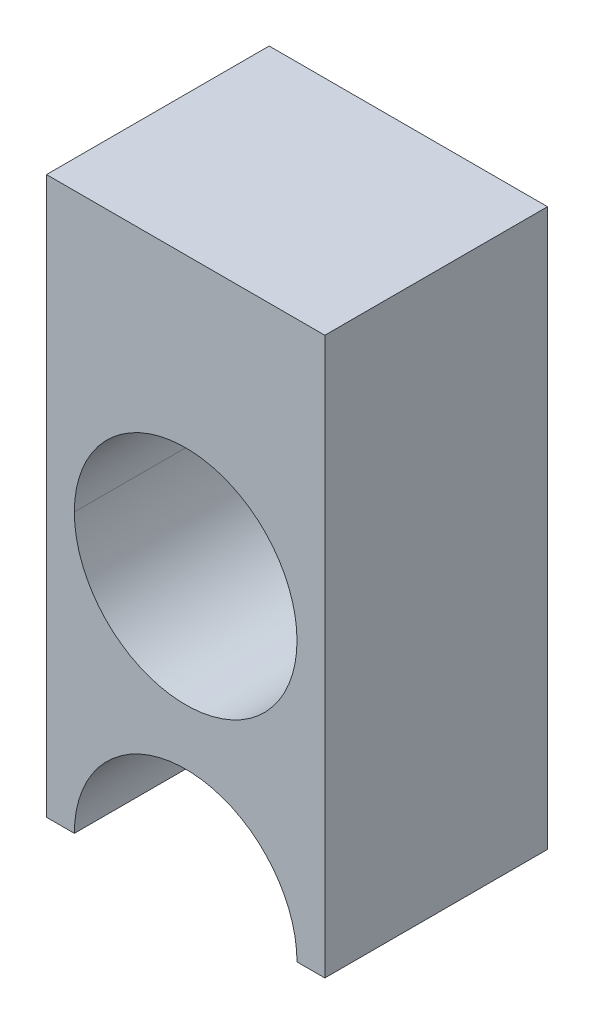
ISO-10303-21;
HEADER;
FILE_DESCRIPTION(('STEP AP214'),'2;1');
FILE_NAME('part.step','',(''),(''),'','','');
FILE_SCHEMA(('AUTOMOTIVE_DESIGN { 1 0 10303 214 1 1 1 1 }'));
ENDSEC;
DATA;
#1=APPLICATION_CONTEXT('core data for automotive mechanical design processes');
#2=APPLICATION_PROTOCOL_DEFINITION('international standard','automotive_design',2000,#1);
#3=PRODUCT_CONTEXT('',#1,'mechanical');
#4=PRODUCT('Part','Part','',(#3));
#5=PRODUCT_RELATED_PRODUCT_CATEGORY('part','',(#4));
#6=PRODUCT_DEFINITION_FORMATION('','',#4);
#7=PRODUCT_DEFINITION_CONTEXT('part definition',#1,'design');
#8=PRODUCT_DEFINITION('design','',#6,#7);
#9=PRODUCT_DEFINITION_SHAPE('','',#8);
#10=(LENGTH_UNIT() NAMED_UNIT(*) SI_UNIT(.MILLI.,.METRE.));
#11=(NAMED_UNIT(*) PLANE_ANGLE_UNIT() SI_UNIT($,.RADIAN.));
#12=(NAMED_UNIT(*) SI_UNIT($,.STERADIAN.) SOLID_ANGLE_UNIT());
#13=UNCERTAINTY_MEASURE_WITH_UNIT(LENGTH_MEASURE(1.E-05),#10,'distance_accuracy_value','');
#14=(GEOMETRIC_REPRESENTATION_CONTEXT(3) GLOBAL_UNCERTAINTY_ASSIGNED_CONTEXT((#13)) GLOBAL_UNIT_ASSIGNED_CONTEXT((#10,
#11,#12)) REPRESENTATION_CONTEXT('',''));
#15=CARTESIAN_POINT('',(0.,0.,0.));
#16=DIRECTION('',(0.,0.,1.));
#17=DIRECTION('',(1.,0.,0.));
#18=AXIS2_PLACEMENT_3D('',#15,#16,#17);
#19=CARTESIAN_POINT('',(0.,1.,0.));
#20=DIRECTION('',(0.,0.,1.));
#21=DIRECTION('',(1.,0.,0.));
#22=AXIS2_PLACEMENT_3D('',#19,#20,#21);
#23=CYLINDRICAL_SURFACE('',#22,0.4);
#24=DIRECTION('',(0.,0.,1.));
#25=VECTOR('',#24,1.);
#26=CARTESIAN_POINT('',(-0.4,1.,0.));
#27=LINE('',#26,#25);
#28=CARTESIAN_POINT('',(-0.4,1.,-0.4));
#29=VERTEX_POINT('',#28);
#30=CARTESIAN_POINT('',(-0.4,1.,0.4));
#31=VERTEX_POINT('',#30);
#32=EDGE_CURVE('E114',#29,#31,#27,.T.);
#33=ORIENTED_EDGE('',*,*,#32,.F.);
#34=CARTESIAN_POINT('',(0.,1.,-0.4));
#35=DIRECTION('',(0.,0.,-1.));
#36=DIRECTION('',(1.,0.,0.));
#37=AXIS2_PLACEMENT_3D('',#34,#35,#36);
#38=CIRCLE('',#37,0.4);
#39=CARTESIAN_POINT('',(0.4,1.,-0.4));
#40=VERTEX_POINT('',#39);
#41=EDGE_CURVE('E102',#29,#40,#38,.T.);
#42=ORIENTED_EDGE('',*,*,#41,.T.);
#43=DIRECTION('',(0.,0.,1.));
#44=VECTOR('',#43,1.);
#45=CARTESIAN_POINT('',(0.4,1.,0.));
#46=LINE('',#45,#44);
#47=CARTESIAN_POINT('',(0.4,1.,0.4));
#48=VERTEX_POINT('',#47);
#49=EDGE_CURVE('E123',#40,#48,#46,.T.);
#50=ORIENTED_EDGE('',*,*,#49,.T.);
#51=CARTESIAN_POINT('',(0.,1.,0.4));
#52=DIRECTION('',(0.,0.,-1.));
#53=DIRECTION('',(1.,0.,0.));
#54=AXIS2_PLACEMENT_3D('',#51,#52,#53);
#55=CIRCLE('',#54,0.4);
#56=EDGE_CURVE('E115',#31,#48,#55,.T.);
#57=ORIENTED_EDGE('',*,*,#56,.F.);
#58=EDGE_LOOP('',(#33,#42,#50,#57));
#59=FACE_BOUND('',#58,.T.);
#60=ADVANCED_FACE('F16',(#59),#23,.F.);
#61=CARTESIAN_POINT('',(0.4,0.,0.));
#62=DIRECTION('',(0.,-1.,0.));
#63=DIRECTION('',(0.,0.,-1.));
#64=AXIS2_PLACEMENT_3D('',#61,#62,#63);
#65=PLANE('',#64);
#66=DIRECTION('',(0.,0.,-1.));
#67=VECTOR('',#66,1.);
#68=CARTESIAN_POINT('',(0.5,0.,0.));
#69=LINE('',#68,#67);
#70=CARTESIAN_POINT('',(0.5,0.,0.4));
#71=VERTEX_POINT('',#70);
#72=CARTESIAN_POINT('',(0.5,0.,-0.4));
#73=VERTEX_POINT('',#72);
#74=EDGE_CURVE('E11',#71,#73,#69,.T.);
#75=ORIENTED_EDGE('',*,*,#74,.F.);
#76=DIRECTION('',(1.,0.,0.));
#77=VECTOR('',#76,1.);
#78=CARTESIAN_POINT('',(0.,0.,0.4));
#79=LINE('',#78,#77);
#80=CARTESIAN_POINT('',(0.4,0.,0.4));
#81=VERTEX_POINT('',#80);
#82=EDGE_CURVE('E152',#81,#71,#79,.T.);
#83=ORIENTED_EDGE('',*,*,#82,.F.);
#84=DIRECTION('',(0.,0.,-1.));
#85=VECTOR('',#84,1.);
#86=CARTESIAN_POINT('',(0.4,0.,0.));
#87=LINE('',#86,#85);
#88=CARTESIAN_POINT('',(0.4,0.,-0.4));
#89=VERTEX_POINT('',#88);
#90=EDGE_CURVE('E26',#81,#89,#87,.T.);
#91=ORIENTED_EDGE('',*,*,#90,.T.);
#92=DIRECTION('',(1.,0.,0.));
#93=VECTOR('',#92,1.);
#94=CARTESIAN_POINT('',(0.,0.,-0.4));
#95=LINE('',#94,#93);
#96=EDGE_CURVE('E135',#89,#73,#95,.T.);
#97=ORIENTED_EDGE('',*,*,#96,.T.);
#98=EDGE_LOOP('',(#75,#83,#91,#97));
#99=FACE_BOUND('',#98,.T.);
#100=ADVANCED_FACE('F247',(#99),#65,.T.);
#101=CARTESIAN_POINT('',(0.5,0.,0.));
#102=DIRECTION('',(1.,0.,0.));
#103=DIRECTION('',(0.,1.,0.));
#104=AXIS2_PLACEMENT_3D('',#101,#102,#103);
#105=PLANE('',#104);
#106=DIRECTION('',(0.,0.,-1.));
#107=VECTOR('',#106,1.);
#108=CARTESIAN_POINT('',(0.5,2.,0.));
#109=LINE('',#108,#107);
#110=CARTESIAN_POINT('',(0.5,2.,0.4));
#111=VERTEX_POINT('',#110);
#112=CARTESIAN_POINT('',(0.5,2.,-0.4));
#113=VERTEX_POINT('',#112);
#114=EDGE_CURVE('E40',#111,#113,#109,.T.);
#115=ORIENTED_EDGE('',*,*,#114,.F.);
#116=DIRECTION('',(0.,1.,0.));
#117=VECTOR('',#116,1.);
#118=CARTESIAN_POINT('',(0.5,1.015877012191,0.4));
#119=LINE('',#118,#117);
#120=EDGE_CURVE('E155',#71,#111,#119,.T.);
#121=ORIENTED_EDGE('',*,*,#120,.F.);
#122=ORIENTED_EDGE('',*,*,#74,.T.);
#123=DIRECTION('',(0.,1.,0.));
#124=VECTOR('',#123,1.);
#125=CARTESIAN_POINT('',(0.5,1.015877012191,-0.4));
#126=LINE('',#125,#124);
#127=EDGE_CURVE('E111',#73,#113,#126,.T.);
#128=ORIENTED_EDGE('',*,*,#127,.T.);
#129=EDGE_LOOP('',(#115,#121,#122,#128));
#130=FACE_BOUND('',#129,.T.);
#131=ADVANCED_FACE('F243',(#130),#105,.T.);
#132=CARTESIAN_POINT('',(0.,0.,0.));
#133=DIRECTION('',(0.,0.,1.));
#134=DIRECTION('',(1.,0.,0.));
#135=AXIS2_PLACEMENT_3D('',#132,#133,#134);
#136=CYLINDRICAL_SURFACE('',#135,0.4);
#137=DIRECTION('',(0.,0.,1.));
#138=VECTOR('',#137,1.);
#139=CARTESIAN_POINT('',(-0.4,0.,0.));
#140=LINE('',#139,#138);
#141=CARTESIAN_POINT('',(-0.4,0.,-0.4));
#142=VERTEX_POINT('',#141);
#143=CARTESIAN_POINT('',(-0.4,0.,0.4));
#144=VERTEX_POINT('',#143);
#145=EDGE_CURVE('E136',#142,#144,#140,.T.);
#146=ORIENTED_EDGE('',*,*,#145,.F.);
#147=CARTESIAN_POINT('',(0.,0.,-0.4));
#148=DIRECTION('',(0.,0.,-1.));
#149=DIRECTION('',(1.,0.,0.));
#150=AXIS2_PLACEMENT_3D('',#147,#148,#149);
#151=CIRCLE('',#150,0.4);
#152=EDGE_CURVE('E83',#142,#89,#151,.T.);
#153=ORIENTED_EDGE('',*,*,#152,.T.);
#154=ORIENTED_EDGE('',*,*,#90,.F.);
#155=CARTESIAN_POINT('',(0.,0.,0.4));
#156=DIRECTION('',(0.,0.,-1.));
#157=DIRECTION('',(1.,0.,0.));
#158=AXIS2_PLACEMENT_3D('',#155,#156,#157);
#159=CIRCLE('',#158,0.4);
#160=EDGE_CURVE('E150',#144,#81,#159,.T.);
#161=ORIENTED_EDGE('',*,*,#160,.F.);
#162=EDGE_LOOP('',(#146,#153,#154,#161));
#163=FACE_BOUND('',#162,.T.);
#164=ADVANCED_FACE('F238',(#163),#136,.F.);
#165=CARTESIAN_POINT('',(0.5,2.,0.));
#166=DIRECTION('',(0.,1.,0.));
#167=DIRECTION('',(1.,0.,0.));
#168=AXIS2_PLACEMENT_3D('',#165,#166,#167);
#169=PLANE('',#168);
#170=DIRECTION('',(0.,0.,-1.));
#171=VECTOR('',#170,1.);
#172=CARTESIAN_POINT('',(-0.5,2.,0.));
#173=LINE('',#172,#171);
#174=CARTESIAN_POINT('',(-0.5,2.,0.4));
#175=VERTEX_POINT('',#174);
#176=CARTESIAN_POINT('',(-0.5,2.,-0.4));
#177=VERTEX_POINT('',#176);
#178=EDGE_CURVE('E145',#175,#177,#173,.T.);
#179=ORIENTED_EDGE('',*,*,#178,.F.);
#180=DIRECTION('',(-1.,0.,0.));
#181=VECTOR('',#180,1.);
#182=CARTESIAN_POINT('',(0.,2.,0.4));
#183=LINE('',#182,#181);
#184=EDGE_CURVE('E19',#111,#175,#183,.T.);
#185=ORIENTED_EDGE('',*,*,#184,.F.);
#186=ORIENTED_EDGE('',*,*,#114,.T.);
#187=DIRECTION('',(-1.,0.,0.));
#188=VECTOR('',#187,1.);
#189=CARTESIAN_POINT('',(0.,2.,-0.4));
#190=LINE('',#189,#188);
#191=EDGE_CURVE('E171',#113,#177,#190,.T.);
#192=ORIENTED_EDGE('',*,*,#191,.T.);
#193=EDGE_LOOP('',(#179,#185,#186,#192));
#194=FACE_BOUND('',#193,.T.);
#195=ADVANCED_FACE('F230',(#194),#169,.T.);
#196=CARTESIAN_POINT('',(0.,1.015877012191,-0.4));
#197=DIRECTION('',(0.,0.,1.));
#198=DIRECTION('',(1.,0.,0.));
#199=AXIS2_PLACEMENT_3D('',#196,#197,#198);
#200=PLANE('',#199);
#201=CARTESIAN_POINT('',(0.,1.,-0.4));
#202=DIRECTION('',(0.,0.,-1.));
#203=DIRECTION('',(1.,0.,0.));
#204=AXIS2_PLACEMENT_3D('',#201,#202,#203);
#205=CIRCLE('',#204,0.4);
#206=EDGE_CURVE('E106',#40,#29,#205,.T.);
#207=ORIENTED_EDGE('',*,*,#206,.F.);
#208=ORIENTED_EDGE('',*,*,#41,.F.);
#209=EDGE_LOOP('',(#207,#208));
#210=FACE_BOUND('',#209,.T.);
#211=ORIENTED_EDGE('',*,*,#96,.F.);
#212=ORIENTED_EDGE('',*,*,#152,.F.);
#213=DIRECTION('',(1.,0.,0.));
#214=VECTOR('',#213,1.);
#215=CARTESIAN_POINT('',(-0.5,0.,-0.4));
#216=LINE('',#215,#214);
#217=CARTESIAN_POINT('',(-0.5,0.,-0.4));
#218=VERTEX_POINT('',#217);
#219=EDGE_CURVE('E133',#218,#142,#216,.T.);
#220=ORIENTED_EDGE('',*,*,#219,.F.);
#221=DIRECTION('',(0.,-1.,0.));
#222=VECTOR('',#221,1.);
#223=CARTESIAN_POINT('',(-0.5,2.,-0.4));
#224=LINE('',#223,#222);
#225=EDGE_CURVE('E151',#177,#218,#224,.T.);
#226=ORIENTED_EDGE('',*,*,#225,.F.);
#227=ORIENTED_EDGE('',*,*,#191,.F.);
#228=ORIENTED_EDGE('',*,*,#127,.F.);
#229=EDGE_LOOP('',(#211,#212,#220,#226,#227,#228));
#230=FACE_BOUND('',#229,.T.);
#231=ADVANCED_FACE('F104',(#210,#230),#200,.F.);
#232=CARTESIAN_POINT('',(-0.5,0.,0.));
#233=DIRECTION('',(0.,-1.,0.));
#234=DIRECTION('',(0.,0.,-1.));
#235=AXIS2_PLACEMENT_3D('',#232,#233,#234);
#236=PLANE('',#235);
#237=ORIENTED_EDGE('',*,*,#145,.T.);
#238=DIRECTION('',(1.,0.,0.));
#239=VECTOR('',#238,1.);
#240=CARTESIAN_POINT('',(0.,0.,0.4));
#241=LINE('',#240,#239);
#242=CARTESIAN_POINT('',(-0.5,0.,0.4));
#243=VERTEX_POINT('',#242);
#244=EDGE_CURVE('E146',#243,#144,#241,.T.);
#245=ORIENTED_EDGE('',*,*,#244,.F.);
#246=DIRECTION('',(0.,0.,1.));
#247=VECTOR('',#246,1.);
#248=CARTESIAN_POINT('',(-0.5,0.,0.));
#249=LINE('',#248,#247);
#250=EDGE_CURVE('E131',#218,#243,#249,.T.);
#251=ORIENTED_EDGE('',*,*,#250,.F.);
#252=ORIENTED_EDGE('',*,*,#219,.T.);
#253=EDGE_LOOP('',(#237,#245,#251,#252));
#254=FACE_BOUND('',#253,.T.);
#255=ADVANCED_FACE('F197',(#254),#236,.T.);
#256=CARTESIAN_POINT('',(0.,1.015877012191,0.4));
#257=DIRECTION('',(0.,0.,1.));
#258=DIRECTION('',(1.,0.,0.));
#259=AXIS2_PLACEMENT_3D('',#256,#257,#258);
#260=PLANE('',#259);
#261=CARTESIAN_POINT('',(0.,1.,0.4));
#262=DIRECTION('',(0.,0.,-1.));
#263=DIRECTION('',(1.,0.,0.));
#264=AXIS2_PLACEMENT_3D('',#261,#262,#263);
#265=CIRCLE('',#264,0.4);
#266=EDGE_CURVE('E120',#48,#31,#265,.T.);
#267=ORIENTED_EDGE('',*,*,#266,.T.);
#268=ORIENTED_EDGE('',*,*,#56,.T.);
#269=EDGE_LOOP('',(#267,#268));
#270=FACE_BOUND('',#269,.T.);
#271=ORIENTED_EDGE('',*,*,#244,.T.);
#272=ORIENTED_EDGE('',*,*,#160,.T.);
#273=ORIENTED_EDGE('',*,*,#82,.T.);
#274=ORIENTED_EDGE('',*,*,#120,.T.);
#275=ORIENTED_EDGE('',*,*,#184,.T.);
#276=DIRECTION('',(0.,1.,0.));
#277=VECTOR('',#276,1.);
#278=CARTESIAN_POINT('',(-0.5,2.,0.4));
#279=LINE('',#278,#277);
#280=EDGE_CURVE('E141',#243,#175,#279,.T.);
#281=ORIENTED_EDGE('',*,*,#280,.F.);
#282=EDGE_LOOP('',(#271,#272,#273,#274,#275,#281));
#283=FACE_BOUND('',#282,.T.);
#284=ADVANCED_FACE('F191',(#270,#283),#260,.T.);
#285=CARTESIAN_POINT('',(-0.5,2.,0.));
#286=DIRECTION('',(-1.,0.,0.));
#287=DIRECTION('',(0.,1.,0.));
#288=AXIS2_PLACEMENT_3D('',#285,#286,#287);
#289=PLANE('',#288);
#290=ORIENTED_EDGE('',*,*,#250,.T.);
#291=ORIENTED_EDGE('',*,*,#280,.T.);
#292=ORIENTED_EDGE('',*,*,#178,.T.);
#293=ORIENTED_EDGE('',*,*,#225,.T.);
#294=EDGE_LOOP('',(#290,#291,#292,#293));
#295=FACE_BOUND('',#294,.T.);
#296=ADVANCED_FACE('F196',(#295),#289,.T.);
#297=CARTESIAN_POINT('',(0.,1.,0.));
#298=DIRECTION('',(0.,0.,1.));
#299=DIRECTION('',(1.,0.,0.));
#300=AXIS2_PLACEMENT_3D('',#297,#298,#299);
#301=CYLINDRICAL_SURFACE('',#300,0.4);
#302=ORIENTED_EDGE('',*,*,#206,.T.);
#303=ORIENTED_EDGE('',*,*,#32,.T.);
#304=ORIENTED_EDGE('',*,*,#266,.F.);
#305=ORIENTED_EDGE('',*,*,#49,.F.);
#306=EDGE_LOOP('',(#302,#303,#304,#305));
#307=FACE_BOUND('',#306,.T.);
#308=ADVANCED_FACE('F122',(#307),#301,.F.);
#309=CLOSED_SHELL('',(#60,#100,#131,#164,#195,#231,#255,#284,#296,#308));
#310=MANIFOLD_SOLID_BREP('B1',#309);
#311=ADVANCED_BREP_SHAPE_REPRESENTATION('',(#18,#310),#14);
#312=SHAPE_DEFINITION_REPRESENTATION(#9,#311);
ENDSEC;
END-ISO-10303-21;
